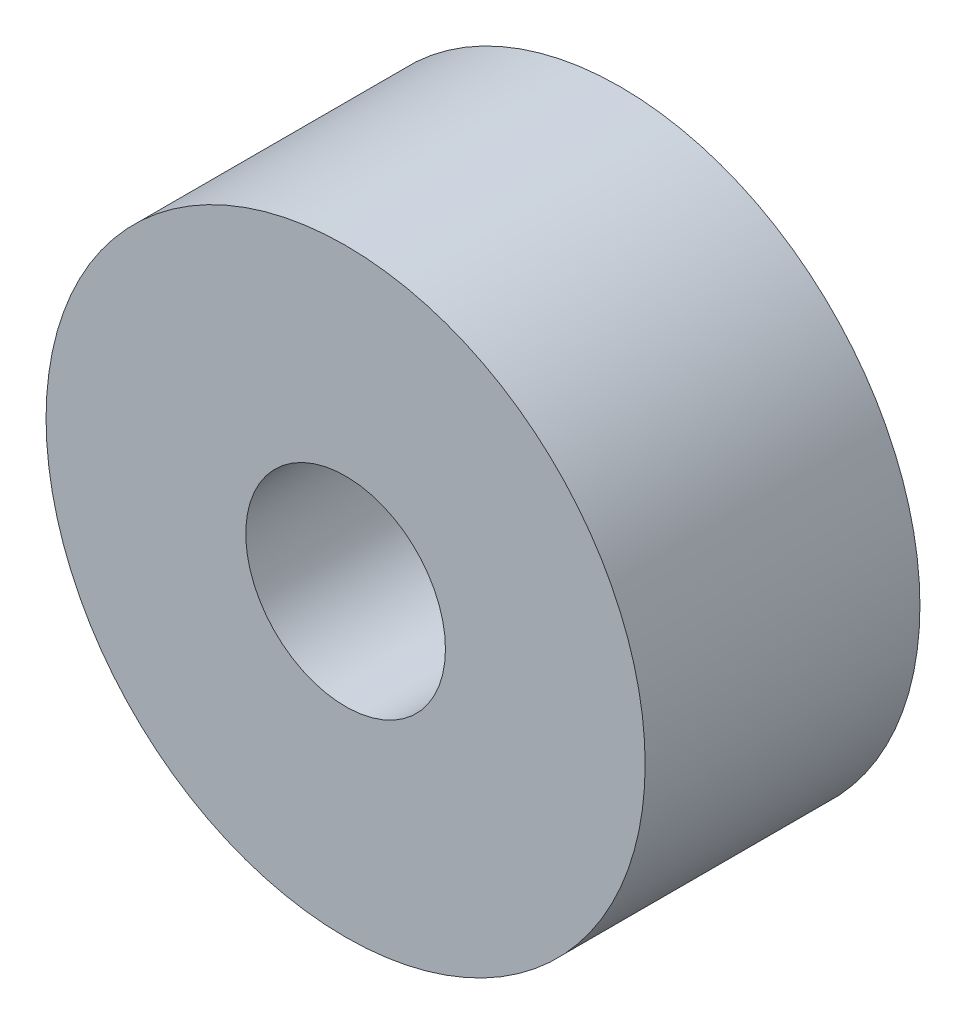
ISO-10303-21;
HEADER;
FILE_DESCRIPTION(('STEP AP214'),'2;1');
FILE_NAME('part.step','',(''),(''),'','','');
FILE_SCHEMA(('AUTOMOTIVE_DESIGN { 1 0 10303 214 1 1 1 1 }'));
ENDSEC;
DATA;
#1=APPLICATION_CONTEXT('core data for automotive mechanical design processes');
#2=APPLICATION_PROTOCOL_DEFINITION('international standard','automotive_design',2000,#1);
#3=PRODUCT_CONTEXT('',#1,'mechanical');
#4=PRODUCT('Part','Part','',(#3));
#5=PRODUCT_RELATED_PRODUCT_CATEGORY('part','',(#4));
#6=PRODUCT_DEFINITION_FORMATION('','',#4);
#7=PRODUCT_DEFINITION_CONTEXT('part definition',#1,'design');
#8=PRODUCT_DEFINITION('design','',#6,#7);
#9=PRODUCT_DEFINITION_SHAPE('','',#8);
#10=(LENGTH_UNIT() NAMED_UNIT(*) SI_UNIT(.MILLI.,.METRE.));
#11=(NAMED_UNIT(*) PLANE_ANGLE_UNIT() SI_UNIT($,.RADIAN.));
#12=(NAMED_UNIT(*) SI_UNIT($,.STERADIAN.) SOLID_ANGLE_UNIT());
#13=UNCERTAINTY_MEASURE_WITH_UNIT(LENGTH_MEASURE(1.E-05),#10,'distance_accuracy_value','');
#14=(GEOMETRIC_REPRESENTATION_CONTEXT(3) GLOBAL_UNCERTAINTY_ASSIGNED_CONTEXT((#13)) GLOBAL_UNIT_ASSIGNED_CONTEXT((#10,
#11,#12)) REPRESENTATION_CONTEXT('',''));
#15=CARTESIAN_POINT('',(0.,0.,0.));
#16=DIRECTION('',(0.,0.,1.));
#17=DIRECTION('',(1.,0.,0.));
#18=AXIS2_PLACEMENT_3D('',#15,#16,#17);
#19=CARTESIAN_POINT('',(0.,0.,6.88));
#20=DIRECTION('',(0.,0.,1.));
#21=DIRECTION('',(1.,0.,0.));
#22=AXIS2_PLACEMENT_3D('',#19,#20,#21);
#23=PLANE('',#22);
#24=CARTESIAN_POINT('',(0.,0.,6.88));
#25=DIRECTION('',(0.,0.,1.));
#26=DIRECTION('',(1.,0.,0.));
#27=AXIS2_PLACEMENT_3D('',#24,#25,#26);
#28=CIRCLE('',#27,7.5);
#29=CARTESIAN_POINT('',(7.5,0.,6.88));
#30=VERTEX_POINT('',#29);
#31=EDGE_CURVE('E10',#30,#30,#28,.T.);
#32=ORIENTED_EDGE('',*,*,#31,.T.);
#33=EDGE_LOOP('',(#32));
#34=FACE_BOUND('',#33,.T.);
#35=CARTESIAN_POINT('',(0.,0.,6.88));
#36=DIRECTION('',(0.,0.,1.));
#37=DIRECTION('',(1.,0.,0.));
#38=AXIS2_PLACEMENT_3D('',#35,#36,#37);
#39=CIRCLE('',#38,2.5);
#40=CARTESIAN_POINT('',(2.5,0.,6.88));
#41=VERTEX_POINT('',#40);
#42=EDGE_CURVE('E42',#41,#41,#39,.T.);
#43=ORIENTED_EDGE('',*,*,#42,.F.);
#44=EDGE_LOOP('',(#43));
#45=FACE_BOUND('',#44,.T.);
#46=ADVANCED_FACE('F31',(#34,#45),#23,.T.);
#47=CARTESIAN_POINT('',(0.,0.,0.));
#48=DIRECTION('',(0.,0.,1.));
#49=DIRECTION('',(1.,0.,0.));
#50=AXIS2_PLACEMENT_3D('',#47,#48,#49);
#51=PLANE('',#50);
#52=CARTESIAN_POINT('',(0.,0.,0.));
#53=DIRECTION('',(0.,0.,1.));
#54=DIRECTION('',(1.,0.,0.));
#55=AXIS2_PLACEMENT_3D('',#52,#53,#54);
#56=CIRCLE('',#55,7.5);
#57=CARTESIAN_POINT('',(7.5,0.,0.));
#58=VERTEX_POINT('',#57);
#59=EDGE_CURVE('E35',#58,#58,#56,.T.);
#60=ORIENTED_EDGE('',*,*,#59,.F.);
#61=EDGE_LOOP('',(#60));
#62=FACE_BOUND('',#61,.T.);
#63=CARTESIAN_POINT('',(0.,0.,0.));
#64=DIRECTION('',(0.,0.,1.));
#65=DIRECTION('',(1.,0.,0.));
#66=AXIS2_PLACEMENT_3D('',#63,#64,#65);
#67=CIRCLE('',#66,2.5);
#68=CARTESIAN_POINT('',(2.5,0.,0.));
#69=VERTEX_POINT('',#68);
#70=EDGE_CURVE('E44',#69,#69,#67,.T.);
#71=ORIENTED_EDGE('',*,*,#70,.T.);
#72=EDGE_LOOP('',(#71));
#73=FACE_BOUND('',#72,.T.);
#74=ADVANCED_FACE('F54',(#62,#73),#51,.F.);
#75=CARTESIAN_POINT('',(0.,0.,6.88));
#76=DIRECTION('',(0.,0.,-1.));
#77=DIRECTION('',(-1.,0.,0.));
#78=AXIS2_PLACEMENT_3D('',#75,#76,#77);
#79=CYLINDRICAL_SURFACE('',#78,7.5);
#80=ORIENTED_EDGE('',*,*,#31,.F.);
#81=EDGE_LOOP('',(#80));
#82=FACE_BOUND('',#81,.T.);
#83=ORIENTED_EDGE('',*,*,#59,.T.);
#84=EDGE_LOOP('',(#83));
#85=FACE_BOUND('',#84,.T.);
#86=ADVANCED_FACE('F33',(#82,#85),#79,.T.);
#87=CARTESIAN_POINT('',(0.,0.,6.88));
#88=DIRECTION('',(0.,0.,-1.));
#89=DIRECTION('',(-1.,0.,0.));
#90=AXIS2_PLACEMENT_3D('',#87,#88,#89);
#91=CYLINDRICAL_SURFACE('',#90,2.5);
#92=ORIENTED_EDGE('',*,*,#42,.T.);
#93=EDGE_LOOP('',(#92));
#94=FACE_BOUND('',#93,.T.);
#95=ORIENTED_EDGE('',*,*,#70,.F.);
#96=EDGE_LOOP('',(#95));
#97=FACE_BOUND('',#96,.T.);
#98=ADVANCED_FACE('F50',(#94,#97),#91,.F.);
#99=CLOSED_SHELL('',(#46,#74,#86,#98));
#100=MANIFOLD_SOLID_BREP('B2',#99);
#101=ADVANCED_BREP_SHAPE_REPRESENTATION('',(#18,#100),#14);
#102=SHAPE_DEFINITION_REPRESENTATION(#9,#101);
ENDSEC;
END-ISO-10303-21;
